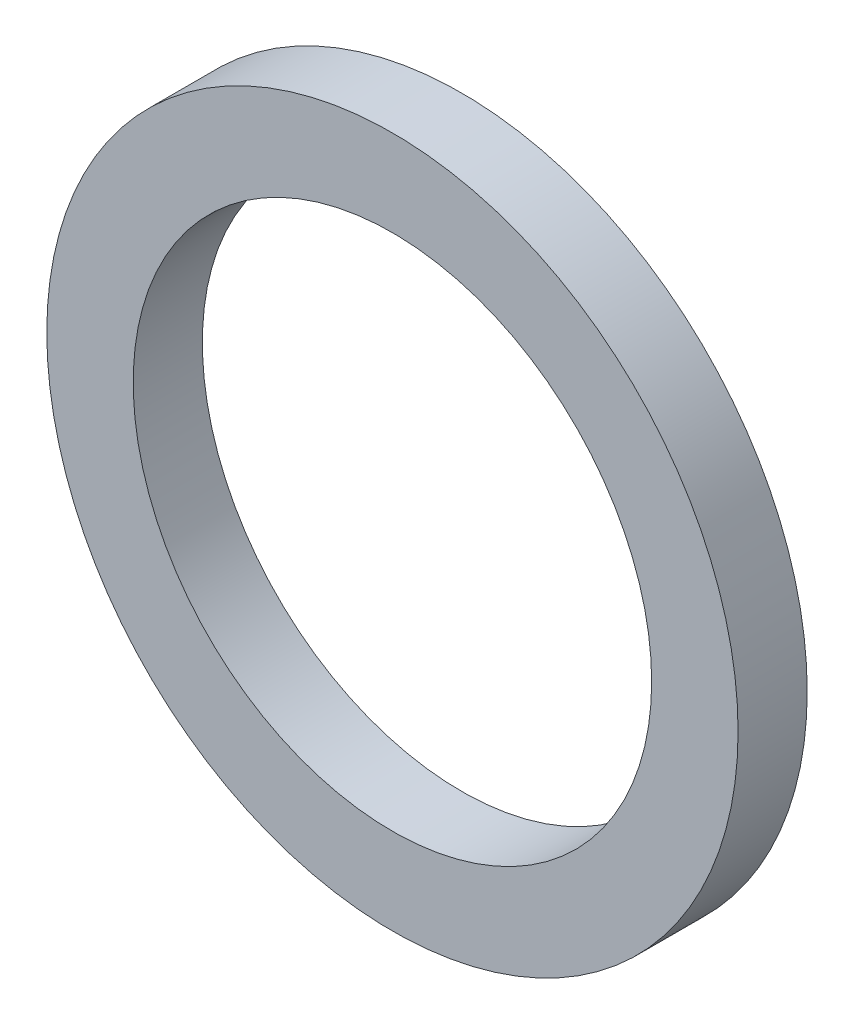
ISO-10303-21;
HEADER;
FILE_DESCRIPTION(('STEP AP214'),'2;1');
FILE_NAME('part.step','',(''),(''),'','','');
FILE_SCHEMA(('AUTOMOTIVE_DESIGN { 1 0 10303 214 1 1 1 1 }'));
ENDSEC;
DATA;
#1=APPLICATION_CONTEXT('core data for automotive mechanical design processes');
#2=APPLICATION_PROTOCOL_DEFINITION('international standard','automotive_design',2000,#1);
#3=PRODUCT_CONTEXT('',#1,'mechanical');
#4=PRODUCT('Part','Part','',(#3));
#5=PRODUCT_RELATED_PRODUCT_CATEGORY('part','',(#4));
#6=PRODUCT_DEFINITION_FORMATION('','',#4);
#7=PRODUCT_DEFINITION_CONTEXT('part definition',#1,'design');
#8=PRODUCT_DEFINITION('design','',#6,#7);
#9=PRODUCT_DEFINITION_SHAPE('','',#8);
#10=(LENGTH_UNIT() NAMED_UNIT(*) SI_UNIT(.MILLI.,.METRE.));
#11=(NAMED_UNIT(*) PLANE_ANGLE_UNIT() SI_UNIT($,.RADIAN.));
#12=(NAMED_UNIT(*) SI_UNIT($,.STERADIAN.) SOLID_ANGLE_UNIT());
#13=UNCERTAINTY_MEASURE_WITH_UNIT(LENGTH_MEASURE(1.E-05),#10,'distance_accuracy_value','');
#14=(GEOMETRIC_REPRESENTATION_CONTEXT(3) GLOBAL_UNCERTAINTY_ASSIGNED_CONTEXT((#13)) GLOBAL_UNIT_ASSIGNED_CONTEXT((#10,
#11,#12)) REPRESENTATION_CONTEXT('',''));
#15=CARTESIAN_POINT('',(0.,0.,0.));
#16=DIRECTION('',(0.,0.,1.));
#17=DIRECTION('',(1.,0.,0.));
#18=AXIS2_PLACEMENT_3D('',#15,#16,#17);
#19=CARTESIAN_POINT('',(0.,0.,2.));
#20=DIRECTION('',(0.,0.,1.));
#21=DIRECTION('',(1.,0.,0.));
#22=AXIS2_PLACEMENT_3D('',#19,#20,#21);
#23=PLANE('',#22);
#24=CARTESIAN_POINT('',(0.,0.,2.));
#25=DIRECTION('',(0.,0.,1.));
#26=DIRECTION('',(1.,0.,0.));
#27=AXIS2_PLACEMENT_3D('',#24,#25,#26);
#28=CIRCLE('',#27,10.);
#29=CARTESIAN_POINT('',(10.,0.,2.));
#30=VERTEX_POINT('',#29);
#31=EDGE_CURVE('E10',#30,#30,#28,.T.);
#32=ORIENTED_EDGE('',*,*,#31,.T.);
#33=EDGE_LOOP('',(#32));
#34=FACE_BOUND('',#33,.T.);
#35=CARTESIAN_POINT('',(0.,0.,2.));
#36=DIRECTION('',(0.,0.,1.));
#37=DIRECTION('',(1.,0.,0.));
#38=AXIS2_PLACEMENT_3D('',#35,#36,#37);
#39=CIRCLE('',#38,7.5);
#40=CARTESIAN_POINT('',(7.5,0.,2.));
#41=VERTEX_POINT('',#40);
#42=EDGE_CURVE('E43',#41,#41,#39,.T.);
#43=ORIENTED_EDGE('',*,*,#42,.F.);
#44=EDGE_LOOP('',(#43));
#45=FACE_BOUND('',#44,.T.);
#46=ADVANCED_FACE('F32',(#34,#45),#23,.T.);
#47=CARTESIAN_POINT('',(0.,0.,0.));
#48=DIRECTION('',(0.,0.,1.));
#49=DIRECTION('',(1.,0.,0.));
#50=AXIS2_PLACEMENT_3D('',#47,#48,#49);
#51=PLANE('',#50);
#52=CARTESIAN_POINT('',(0.,0.,0.));
#53=DIRECTION('',(0.,0.,1.));
#54=DIRECTION('',(1.,0.,0.));
#55=AXIS2_PLACEMENT_3D('',#52,#53,#54);
#56=CIRCLE('',#55,10.);
#57=CARTESIAN_POINT('',(10.,0.,0.));
#58=VERTEX_POINT('',#57);
#59=EDGE_CURVE('E36',#58,#58,#56,.T.);
#60=ORIENTED_EDGE('',*,*,#59,.F.);
#61=EDGE_LOOP('',(#60));
#62=FACE_BOUND('',#61,.T.);
#63=CARTESIAN_POINT('',(0.,0.,0.));
#64=DIRECTION('',(0.,0.,1.));
#65=DIRECTION('',(1.,0.,0.));
#66=AXIS2_PLACEMENT_3D('',#63,#64,#65);
#67=CIRCLE('',#66,7.5);
#68=CARTESIAN_POINT('',(7.5,0.,0.));
#69=VERTEX_POINT('',#68);
#70=EDGE_CURVE('E45',#69,#69,#67,.T.);
#71=ORIENTED_EDGE('',*,*,#70,.T.);
#72=EDGE_LOOP('',(#71));
#73=FACE_BOUND('',#72,.T.);
#74=ADVANCED_FACE('F55',(#62,#73),#51,.F.);
#75=CARTESIAN_POINT('',(0.,0.,2.));
#76=DIRECTION('',(0.,0.,-1.));
#77=DIRECTION('',(-1.,0.,0.));
#78=AXIS2_PLACEMENT_3D('',#75,#76,#77);
#79=CYLINDRICAL_SURFACE('',#78,10.);
#80=ORIENTED_EDGE('',*,*,#31,.F.);
#81=EDGE_LOOP('',(#80));
#82=FACE_BOUND('',#81,.T.);
#83=ORIENTED_EDGE('',*,*,#59,.T.);
#84=EDGE_LOOP('',(#83));
#85=FACE_BOUND('',#84,.T.);
#86=ADVANCED_FACE('F34',(#82,#85),#79,.T.);
#87=CARTESIAN_POINT('',(0.,0.,2.));
#88=DIRECTION('',(0.,0.,-1.));
#89=DIRECTION('',(-1.,0.,0.));
#90=AXIS2_PLACEMENT_3D('',#87,#88,#89);
#91=CYLINDRICAL_SURFACE('',#90,7.5);
#92=ORIENTED_EDGE('',*,*,#42,.T.);
#93=EDGE_LOOP('',(#92));
#94=FACE_BOUND('',#93,.T.);
#95=ORIENTED_EDGE('',*,*,#70,.F.);
#96=EDGE_LOOP('',(#95));
#97=FACE_BOUND('',#96,.T.);
#98=ADVANCED_FACE('F51',(#94,#97),#91,.F.);
#99=CLOSED_SHELL('',(#46,#74,#86,#98));
#100=MANIFOLD_SOLID_BREP('B2',#99);
#101=ADVANCED_BREP_SHAPE_REPRESENTATION('',(#18,#100),#14);
#102=SHAPE_DEFINITION_REPRESENTATION(#9,#101);
ENDSEC;
END-ISO-10303-21;
